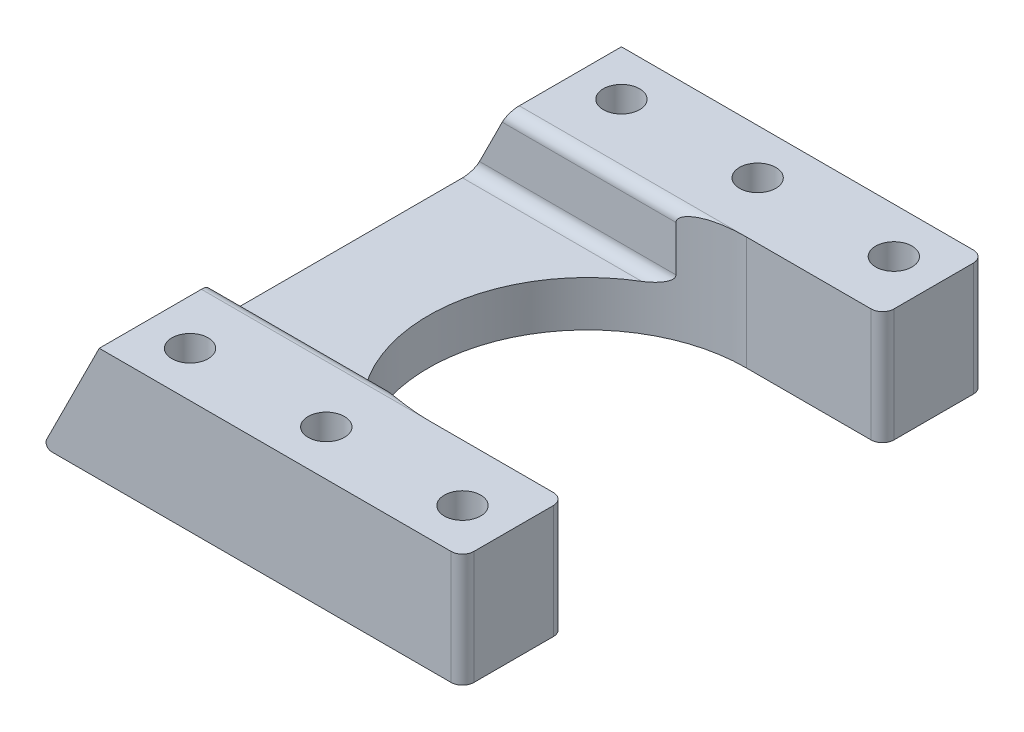
ISO-10303-21;
HEADER;
FILE_DESCRIPTION(('STEP AP214'),'2;1');
FILE_NAME('part.step','',(''),(''),'','','');
FILE_SCHEMA(('AUTOMOTIVE_DESIGN { 1 0 10303 214 1 1 1 1 }'));
ENDSEC;
DATA;
#1=APPLICATION_CONTEXT('core data for automotive mechanical design processes');
#2=APPLICATION_PROTOCOL_DEFINITION('international standard','automotive_design',2000,#1);
#3=PRODUCT_CONTEXT('',#1,'mechanical');
#4=PRODUCT('Part','Part','',(#3));
#5=PRODUCT_RELATED_PRODUCT_CATEGORY('part','',(#4));
#6=PRODUCT_DEFINITION_FORMATION('','',#4);
#7=PRODUCT_DEFINITION_CONTEXT('part definition',#1,'design');
#8=PRODUCT_DEFINITION('design','',#6,#7);
#9=PRODUCT_DEFINITION_SHAPE('','',#8);
#10=(LENGTH_UNIT() NAMED_UNIT(*) SI_UNIT(.MILLI.,.METRE.));
#11=(NAMED_UNIT(*) PLANE_ANGLE_UNIT() SI_UNIT($,.RADIAN.));
#12=(NAMED_UNIT(*) SI_UNIT($,.STERADIAN.) SOLID_ANGLE_UNIT());
#13=UNCERTAINTY_MEASURE_WITH_UNIT(LENGTH_MEASURE(1.E-05),#10,'distance_accuracy_value','');
#14=(GEOMETRIC_REPRESENTATION_CONTEXT(3) GLOBAL_UNCERTAINTY_ASSIGNED_CONTEXT((#13)) GLOBAL_UNIT_ASSIGNED_CONTEXT((#10,
#11,#12)) REPRESENTATION_CONTEXT('',''));
#15=CARTESIAN_POINT('',(0.,0.,0.));
#16=DIRECTION('',(0.,0.,1.));
#17=DIRECTION('',(1.,0.,0.));
#18=AXIS2_PLACEMENT_3D('',#15,#16,#17);
#19=CARTESIAN_POINT('',(0.,10.,0.));
#20=DIRECTION('',(0.,1.,0.));
#21=DIRECTION('',(0.,0.,1.));
#22=AXIS2_PLACEMENT_3D('',#19,#20,#21);
#23=PLANE('',#22);
#24=CARTESIAN_POINT('',(-12.,10.,19.));
#25=DIRECTION('',(0.,1.,0.));
#26=DIRECTION('',(0.,0.,1.));
#27=AXIS2_PLACEMENT_3D('',#24,#25,#26);
#28=CIRCLE('',#27,1.6);
#29=CARTESIAN_POINT('',(-12.,10.,20.6));
#30=VERTEX_POINT('',#29);
#31=EDGE_CURVE('E407',#30,#30,#28,.F.);
#32=ORIENTED_EDGE('',*,*,#31,.T.);
#33=EDGE_LOOP('',(#32));
#34=FACE_BOUND('',#33,.T.);
#35=CARTESIAN_POINT('',(12.,10.,19.));
#36=DIRECTION('',(0.,1.,0.));
#37=DIRECTION('',(0.,0.,1.));
#38=AXIS2_PLACEMENT_3D('',#35,#36,#37);
#39=CIRCLE('',#38,1.6);
#40=CARTESIAN_POINT('',(12.,10.,20.6));
#41=VERTEX_POINT('',#40);
#42=EDGE_CURVE('E466',#41,#41,#39,.T.);
#43=ORIENTED_EDGE('',*,*,#42,.F.);
#44=EDGE_LOOP('',(#43));
#45=FACE_BOUND('',#44,.T.);
#46=CARTESIAN_POINT('',(0.,10.,19.));
#47=DIRECTION('',(0.,1.,0.));
#48=DIRECTION('',(0.,0.,1.));
#49=AXIS2_PLACEMENT_3D('',#46,#47,#48);
#50=CIRCLE('',#49,1.6);
#51=CARTESIAN_POINT('',(0.,10.,20.6));
#52=VERTEX_POINT('',#51);
#53=EDGE_CURVE('E370',#52,#52,#50,.F.);
#54=ORIENTED_EDGE('',*,*,#53,.T.);
#55=EDGE_LOOP('',(#54));
#56=FACE_BOUND('',#55,.T.);
#57=DIRECTION('',(0.,0.,-1.));
#58=VECTOR('',#57,1.);
#59=CARTESIAN_POINT('',(16.,10.,0.));
#60=LINE('',#59,#58);
#61=CARTESIAN_POINT('',(16.,10.,22.));
#62=VERTEX_POINT('',#61);
#63=CARTESIAN_POINT('',(16.,10.,15.));
#64=VERTEX_POINT('',#63);
#65=EDGE_CURVE('E365',#62,#64,#60,.T.);
#66=ORIENTED_EDGE('',*,*,#65,.T.);
#67=CARTESIAN_POINT('',(15.,10.,15.));
#68=DIRECTION('',(0.,1.,0.));
#69=DIRECTION('',(0.,0.,1.));
#70=AXIS2_PLACEMENT_3D('',#67,#68,#69);
#71=CIRCLE('',#70,1.);
#72=CARTESIAN_POINT('',(15.,10.,14.));
#73=VERTEX_POINT('',#72);
#74=EDGE_CURVE('E43',#64,#73,#71,.T.);
#75=ORIENTED_EDGE('',*,*,#74,.T.);
#76=DIRECTION('',(1.,0.,0.));
#77=VECTOR('',#76,1.);
#78=CARTESIAN_POINT('',(0.,10.,14.));
#79=LINE('',#78,#77);
#80=CARTESIAN_POINT('',(4.,10.,14.));
#81=VERTEX_POINT('',#80);
#82=EDGE_CURVE('E363',#81,#73,#79,.T.);
#83=ORIENTED_EDGE('',*,*,#82,.F.);
#84=DIRECTION('',(-1.,0.,0.));
#85=VECTOR('',#84,1.);
#86=CARTESIAN_POINT('',(0.,10.,14.));
#87=LINE('',#86,#85);
#88=CARTESIAN_POINT('',(-16.,10.,14.));
#89=VERTEX_POINT('',#88);
#90=EDGE_CURVE('E430',#81,#89,#87,.T.);
#91=ORIENTED_EDGE('',*,*,#90,.T.);
#92=DIRECTION('',(0.,0.,-1.));
#93=VECTOR('',#92,1.);
#94=CARTESIAN_POINT('',(-16.,10.,0.));
#95=LINE('',#94,#93);
#96=CARTESIAN_POINT('',(-16.,10.,23.));
#97=VERTEX_POINT('',#96);
#98=EDGE_CURVE('E460',#97,#89,#95,.T.);
#99=ORIENTED_EDGE('',*,*,#98,.F.);
#100=DIRECTION('',(-1.,0.,0.));
#101=VECTOR('',#100,1.);
#102=CARTESIAN_POINT('',(0.,10.,23.));
#103=LINE('',#102,#101);
#104=CARTESIAN_POINT('',(15.,10.,23.));
#105=VERTEX_POINT('',#104);
#106=EDGE_CURVE('E457',#105,#97,#103,.T.);
#107=ORIENTED_EDGE('',*,*,#106,.F.);
#108=CARTESIAN_POINT('',(15.,10.,22.));
#109=DIRECTION('',(0.,1.,0.));
#110=DIRECTION('',(0.,0.,1.));
#111=AXIS2_PLACEMENT_3D('',#108,#109,#110);
#112=CIRCLE('',#111,1.);
#113=EDGE_CURVE('E358',#105,#62,#112,.T.);
#114=ORIENTED_EDGE('',*,*,#113,.T.);
#115=EDGE_LOOP('',(#66,#75,#83,#91,#99,#107,#114));
#116=FACE_BOUND('',#115,.T.);
#117=ADVANCED_FACE('F35',(#34,#45,#56,#116),#23,.T.);
#118=CARTESIAN_POINT('',(4.,10.,0.));
#119=DIRECTION('',(0.,-1.,0.));
#120=DIRECTION('',(0.,0.,-1.));
#121=AXIS2_PLACEMENT_3D('',#118,#119,#120);
#122=CYLINDRICAL_SURFACE('',#121,14.);
#123=DIRECTION('',(0.,1.,0.));
#124=VECTOR('',#123,1.);
#125=CARTESIAN_POINT('',(-1.19615242270666,4.,13.));
#126=LINE('',#125,#124);
#127=CARTESIAN_POINT('',(-1.19615242270666,5.,13.));
#128=VERTEX_POINT('',#127);
#129=CARTESIAN_POINT('',(-1.19615242270666,9.,13.));
#130=VERTEX_POINT('',#129);
#131=EDGE_CURVE('E441',#128,#130,#126,.T.);
#132=ORIENTED_EDGE('',*,*,#131,.T.);
#133=CARTESIAN_POINT('',(-1.19615242270666,9.,13.));
#134=CARTESIAN_POINT('',(-1.19621155929245,9.02326883844908,12.9999746090349));
#135=CARTESIAN_POINT('',(-1.19412366838426,9.04645231571868,13.0008109831838));
#136=CARTESIAN_POINT('',(-1.18620671547382,9.09178549195957,13.003972054622));
#137=CARTESIAN_POINT('',(-1.18042377587522,9.11394437325585,13.0062784025037));
#138=CARTESIAN_POINT('',(-1.16393306040799,9.16194990718617,13.0128353920137));
#139=CARTESIAN_POINT('',(-1.15239436440986,9.18746056263273,13.0174128243628));
#140=CARTESIAN_POINT('',(-1.12561377801982,9.23623202340418,13.0279811762719));
#141=CARTESIAN_POINT('',(-1.11035332028763,9.25948070414224,13.0339791783796));
#142=CARTESIAN_POINT('',(-1.06702980540213,9.31716391395134,13.0509011677575));
#143=CARTESIAN_POINT('',(-1.03684096871949,9.34975507401489,13.0625959329902));
#144=CARTESIAN_POINT('',(-0.972346066889078,9.40988465234473,13.0872831285143));
#145=CARTESIAN_POINT('',(-0.938032150146151,9.43741317438558,13.1002780253085));
#146=CARTESIAN_POINT('',(-0.865845951071429,9.48908245903096,13.1272642768222));
#147=CARTESIAN_POINT('',(-0.82790371472551,9.51311479623987,13.1412728684084));
#148=CARTESIAN_POINT('',(-0.750142360013684,9.55776590692111,13.1695810401844));
#149=CARTESIAN_POINT('',(-0.710321265336998,9.57838097819591,13.183880917363));
#150=CARTESIAN_POINT('',(-0.629279929652227,9.61685266907429,13.2125553862747));
#151=CARTESIAN_POINT('',(-0.588056556821592,9.63470254198432,13.2269300749717));
#152=CARTESIAN_POINT('',(-0.504666444073828,9.66805215967762,13.2555620363969));
#153=CARTESIAN_POINT('',(-0.462500161574032,9.6835530167846,13.2698193616562));
#154=CARTESIAN_POINT('',(-0.350950248488156,9.7216281193214,13.3069348724708));
#155=CARTESIAN_POINT('',(-0.280963396964905,9.74259892788923,13.3296223342599));
#156=CARTESIAN_POINT('',(-0.139640736942752,9.78051939433019,13.3741868702506));
#157=CARTESIAN_POINT('',(-0.0683042269395927,9.7974668953796,13.3960635045031));
#158=CARTESIAN_POINT('',(0.0754663780222312,9.8281586982092,13.4388865259337));
#159=CARTESIAN_POINT('',(0.147902195321745,9.84189726523543,13.4598311943324));
#160=CARTESIAN_POINT('',(0.293526692814418,9.86673325489727,13.5006584664385));
#161=CARTESIAN_POINT('',(0.366715498056652,9.87783023120812,13.520540890229));
#162=CARTESIAN_POINT('',(0.588204252734463,9.9080206344283,13.5787720721421));
#163=CARTESIAN_POINT('',(0.737409120716898,9.92381153792844,13.6154010713851));
#164=CARTESIAN_POINT('',(1.03724221840706,9.94937995136098,13.6837753636723));
#165=CARTESIAN_POINT('',(1.18786891174778,9.95916333289377,13.7155254024547));
#166=CARTESIAN_POINT('',(1.4497847835244,9.97254351623535,13.7662311376353));
#167=CARTESIAN_POINT('',(1.56080623327312,9.97709544733007,13.7863361622911));
#168=CARTESIAN_POINT('',(1.78335718287695,9.98455093978449,13.8238645922267));
#169=CARTESIAN_POINT('',(1.89488670653176,9.98745442310876,13.8412878705276));
#170=CARTESIAN_POINT('',(2.23022155239792,9.99441802019285,13.8895247564849));
#171=CARTESIAN_POINT('',(2.45466399118253,9.99672670065982,13.9162842777269));
#172=CARTESIAN_POINT('',(2.78935215926388,9.99869698868909,13.9479924957282));
#173=CARTESIAN_POINT('',(2.89922541894034,9.99910870294574,13.9570932475038));
#174=CARTESIAN_POINT('',(3.11916113347007,9.99965858045486,13.9726974453088));
#175=CARTESIAN_POINT('',(3.22922358876056,9.99979674307431,13.9792008853279));
#176=CARTESIAN_POINT('',(3.4493746733248,9.99995991630208,13.9896013317003));
#177=CARTESIAN_POINT('',(3.55946319663439,9.99998502518918,13.9935005993751));
#178=CARTESIAN_POINT('',(3.77970097700538,9.99999976722169,13.9987000288461));
#179=CARTESIAN_POINT('',(3.88985023371476,9.99998940057059,14.000000205551));
#180=CARTESIAN_POINT('',(4.,10.,14.));
#181=B_SPLINE_CURVE_WITH_KNOTS('',3,(#133,#134,#135,#136,#137,#138,#139,#140,#141,#142,#143,
#144,#145,#146,#147,#148,#149,#150,#151,#152,#153,#154,#155,#156,#157,#158,#159,#160,#161,#162,
#163,#164,#165,#166,#167,#168,#169,#170,#171,#172,#173,#174,#175,#176,#177,#178,#179,#180),
.UNSPECIFIED.,.F.,.F.,(4,2,2,2,2,2,2,2,2,2,2,2,2,2,2,2,2,2,2,2,2,2,2,4),(0.,0.0695604029523801,
0.138269062520741,0.222906459420441,0.307975062569036,0.445014168846956,0.582318370153341,
0.723241793143243,0.864316905811288,1.0057309772623,1.14707787459053,1.37641254587527,
1.6058698831761,1.83573420349717,2.06563733430892,2.52867899895899,2.99126737501997,
3.32997632171573,3.6687013011269,4.34648468623733,4.67721398820826,5.00794405551398,
5.3383865601396,5.66882716931128),.UNSPECIFIED.);
#182=EDGE_CURVE('E187',#130,#81,#181,.T.);
#183=ORIENTED_EDGE('',*,*,#182,.T.);
#184=DIRECTION('',(0.,-1.,0.));
#185=VECTOR('',#184,1.);
#186=CARTESIAN_POINT('',(4.,10.,14.));
#187=LINE('',#186,#185);
#188=CARTESIAN_POINT('',(4.,0.,14.));
#189=VERTEX_POINT('',#188);
#190=EDGE_CURVE('E203',#81,#189,#187,.T.);
#191=ORIENTED_EDGE('',*,*,#190,.T.);
#192=CARTESIAN_POINT('',(4.,0.,0.));
#193=DIRECTION('',(0.,1.,0.));
#194=DIRECTION('',(0.,0.,1.));
#195=AXIS2_PLACEMENT_3D('',#192,#193,#194);
#196=CIRCLE('',#195,14.);
#197=CARTESIAN_POINT('',(4.,0.,-14.));
#198=VERTEX_POINT('',#197);
#199=EDGE_CURVE('E198',#198,#189,#196,.T.);
#200=ORIENTED_EDGE('',*,*,#199,.F.);
#201=DIRECTION('',(0.,-1.,0.));
#202=VECTOR('',#201,1.);
#203=CARTESIAN_POINT('',(4.,10.,-14.));
#204=LINE('',#203,#202);
#205=CARTESIAN_POINT('',(4.,10.,-14.));
#206=VERTEX_POINT('',#205);
#207=EDGE_CURVE('E191',#206,#198,#204,.T.);
#208=ORIENTED_EDGE('',*,*,#207,.F.);
#209=CARTESIAN_POINT('',(4.,10.,-14.));
#210=CARTESIAN_POINT('',(3.91667270580262,9.999997382173,-13.9999999921816));
#211=CARTESIAN_POINT('',(3.83334724636329,10.0000003507679,-13.999256038613));
#212=CARTESIAN_POINT('',(3.66672282750631,9.99999466876353,-13.9962805711568));
#213=CARTESIAN_POINT('',(3.58342386810937,9.99998601815529,-13.9940490561092));
#214=CARTESIAN_POINT('',(3.33358515966063,9.9999084444079,-13.9851230948774));
#215=CARTESIAN_POINT('',(3.16711962047872,9.99978789107919,-13.9761972327059));
#216=CARTESIAN_POINT('',(2.83346497470961,9.99893442277258,-13.9523247368353));
#217=CARTESIAN_POINT('',(2.6662788599673,9.99819726541892,-13.9373367644087));
#218=CARTESIAN_POINT('',(2.33257613759479,9.99528757128193,-13.9013616368291));
#219=CARTESIAN_POINT('',(2.16605946980408,9.99311516651687,-13.8803750335486));
#220=CARTESIAN_POINT('',(1.85262444854146,9.98654970055919,-13.8351346735981));
#221=CARTESIAN_POINT('',(1.70560900104655,9.98243399406508,-13.8115141905749));
#222=CARTESIAN_POINT('',(1.41248664657182,9.9710417338234,-13.7596121899918));
#223=CARTESIAN_POINT('',(1.2663799146633,9.96376458903232,-13.7313298014839));
#224=CARTESIAN_POINT('',(0.97595069753571,9.944625186677,-13.6702986811321));
#225=CARTESIAN_POINT('',(0.831623654383101,9.93277970975279,-13.6375665758775));
#226=CARTESIAN_POINT('',(0.54475083610507,9.90254849248921,-13.5677194020871));
#227=CARTESIAN_POINT('',(0.402204161606079,9.8841662050913,-13.5306066544408));
#228=CARTESIAN_POINT('',(0.173208643576799,9.8466727193343,-13.4671444173303));
#229=CARTESIAN_POINT('',(0.0859416085731874,9.8304690018882,-13.4420356423507));
#230=CARTESIAN_POINT('',(-0.0873901028472296,9.79331439416493,-13.3903481870802));
#231=CARTESIAN_POINT('',(-0.173451726825549,9.77235318313454,-13.3637664074929));
#232=CARTESIAN_POINT('',(-0.306983321158923,9.73454753243577,-13.321129668914));
#233=CARTESIAN_POINT('',(-0.355166563052418,9.71979616796571,-13.3054521233923));
#234=CARTESIAN_POINT('',(-0.45062988049977,9.68787753605931,-13.2738245597088));
#235=CARTESIAN_POINT('',(-0.497910201018883,9.67071093477097,-13.2578746177391));
#236=CARTESIAN_POINT('',(-0.591122516401272,9.63351790348163,-13.2258842598309));
#237=CARTESIAN_POINT('',(-0.637058292092062,9.61350066002125,-13.2098442876471));
#238=CARTESIAN_POINT('',(-0.727220554930757,9.56991070759181,-13.1778475722153));
#239=CARTESIAN_POINT('',(-0.771448627360082,9.54634140083754,-13.1618907642811));
#240=CARTESIAN_POINT('',(-0.846239840091492,9.50140892203561,-13.1345007687811));
#241=CARTESIAN_POINT('',(-0.877371152330155,9.48105993366344,-13.1229680545084));
#242=CARTESIAN_POINT('',(-0.93774930020033,9.43734578866155,-13.1003690805453));
#243=CARTESIAN_POINT('',(-0.966992870902146,9.41397560578894,-13.089303639879));
#244=CARTESIAN_POINT('',(-1.0229274047952,9.36336348166741,-13.0679418756553));
#245=CARTESIAN_POINT('',(-1.04958689955929,9.33608193523571,-13.057655304188));
#246=CARTESIAN_POINT('',(-1.09834972576941,9.2771956107542,-13.0386927598236));
#247=CARTESIAN_POINT('',(-1.12046817119275,9.24560577618087,-13.0300114540308));
#248=CARTESIAN_POINT('',(-1.15019529318978,9.19146370202843,-13.0182808297621));
#249=CARTESIAN_POINT('',(-1.16006901319736,9.17035035364829,-13.0143676893522));
#250=CARTESIAN_POINT('',(-1.17655590347143,9.12672439134974,-13.0078187163056));
#251=CARTESIAN_POINT('',(-1.18317867478326,9.10421612154,-13.005179122895));
#252=CARTESIAN_POINT('',(-1.19059234114798,9.06794641743643,-13.0022213457352));
#253=CARTESIAN_POINT('',(-1.1926643243312,9.05448015086148,-13.001393810887));
#254=CARTESIAN_POINT('',(-1.19544992672893,9.02734668889408,-13.0002807955507));
#255=CARTESIAN_POINT('',(-1.19615954874276,9.0136790204396,-12.9999969101493));
#256=CARTESIAN_POINT('',(-1.19615242270667,9.,-13.));
#257=B_SPLINE_CURVE_WITH_KNOTS('',3,(#209,#210,#211,#212,#213,#214,#215,#216,#217,#218,#219,
#220,#221,#222,#223,#224,#225,#226,#227,#228,#229,#230,#231,#232,#233,#234,#235,#236,#237,#238,
#239,#240,#241,#242,#243,#244,#245,#246,#247,#248,#249,#250,#251,#252,#253,#254,#255,#256),
.UNSPECIFIED.,.F.,.F.,(4,2,2,2,2,2,2,2,2,2,2,2,2,2,2,2,2,2,2,2,2,2,2,4),(0.,0.24997489271353,
0.499949980361239,0.999948248263364,1.50341518777454,2.00683582336483,2.45361488313939,
2.9004775060122,3.34571408748745,3.79071583001053,4.06734215043893,4.34457441025026,
4.5028450909286,4.66107220413448,4.81880048906629,4.97637864871527,5.09307293663993,
5.20996392470071,5.328135271671,5.44590669410742,5.51657277116685,5.58702887490565,
5.62790465416739,5.66890018176074),.UNSPECIFIED.);
#258=CARTESIAN_POINT('',(-1.19615242270666,9.,-13.));
#259=VERTEX_POINT('',#258);
#260=EDGE_CURVE('E195',#206,#259,#257,.T.);
#261=ORIENTED_EDGE('',*,*,#260,.T.);
#262=DIRECTION('',(0.,1.,0.));
#263=VECTOR('',#262,1.);
#264=CARTESIAN_POINT('',(-1.19615242270666,4.,-13.));
#265=LINE('',#264,#263);
#266=CARTESIAN_POINT('',(-1.19615242270666,5.,-13.));
#267=VERTEX_POINT('',#266);
#268=EDGE_CURVE('E438',#267,#259,#265,.T.);
#269=ORIENTED_EDGE('',*,*,#268,.F.);
#270=CARTESIAN_POINT('',(-1.19615242270666,5.,-13.));
#271=CARTESIAN_POINT('',(-1.1960825527967,4.97616947585144,-13.0000260880498));
#272=CARTESIAN_POINT('',(-1.19828045897355,4.9524447917133,-12.9991495266409));
#273=CARTESIAN_POINT('',(-1.2065439150981,4.90611315282051,-12.9958428658323));
#274=CARTESIAN_POINT('',(-1.21255585022912,4.88349531246433,-12.9934343010053));
#275=CARTESIAN_POINT('',(-1.22988603155872,4.83362661474541,-12.9864696511788));
#276=CARTESIAN_POINT('',(-1.24220273480728,4.80678866173612,-12.9815076657905));
#277=CARTESIAN_POINT('',(-1.27062142015569,4.75545052033216,-12.9699957266748));
#278=CARTESIAN_POINT('',(-1.28674553022625,4.73096522215295,-12.9634364827213));
#279=CARTESIAN_POINT('',(-1.33447484551546,4.66702232814981,-12.9438956407086));
#280=CARTESIAN_POINT('',(-1.36870098585942,4.62990735931081,-12.9297555032203));
#281=CARTESIAN_POINT('',(-1.44134659077134,4.56116726129249,-12.8993534920001));
#282=CARTESIAN_POINT('',(-1.47977546157365,4.52955487465583,-12.8830868423036));
#283=CARTESIAN_POINT('',(-1.563280447697,4.46749972316987,-12.8472636455486));
#284=CARTESIAN_POINT('',(-1.60863097688795,4.43752757200054,-12.8275409875363));
#285=CARTESIAN_POINT('',(-1.70119141813956,4.38166094090691,-12.7866722038244));
#286=CARTESIAN_POINT('',(-1.74840334391552,4.35577103750437,-12.7655245179224));
#287=CARTESIAN_POINT('',(-1.84420687025744,4.30728552661136,-12.721950611533));
#288=CARTESIAN_POINT('',(-1.89280362737005,4.28470491525307,-12.6995191749121));
#289=CARTESIAN_POINT('',(-1.99075320197156,4.24252700741248,-12.6536083852518));
#290=CARTESIAN_POINT('',(-2.04010577036381,4.22292875035736,-12.6301293727855));
#291=CARTESIAN_POINT('',(-2.18312415907859,4.17026275448213,-12.5610396768027));
#292=CARTESIAN_POINT('',(-2.27744916912481,4.14057695405149,-12.5141884336242));
#293=CARTESIAN_POINT('',(-2.46683331294052,4.08962806294141,-12.4173831987058));
#294=CARTESIAN_POINT('',(-2.56189299149759,4.06837199009579,-12.3674266616274));
#295=CARTESIAN_POINT('',(-2.74979402056507,4.03453948172846,-12.2658637297546));
#296=CARTESIAN_POINT('',(-2.84263582642963,4.0217736654036,-12.2143222190176));
#297=CARTESIAN_POINT('',(-2.98134714975036,4.00882596808806,-12.1352224952575));
#298=CARTESIAN_POINT('',(-3.02746384189736,4.00554369137089,-12.1085751429506));
#299=CARTESIAN_POINT('',(-3.11947090556644,4.00113277333784,-12.0547076897138));
#300=CARTESIAN_POINT('',(-3.16536125290369,4.00000435739318,-12.0274875291488));
#301=CARTESIAN_POINT('',(-3.211102550928,4.,-12.));
#302=B_SPLINE_CURVE_WITH_KNOTS('',3,(#270,#271,#272,#273,#274,#275,#276,#277,#278,#279,#280,
#281,#282,#283,#284,#285,#286,#287,#288,#289,#290,#291,#292,#293,#294,#295,#296,#297,#298,#299,
#300,#301),.UNSPECIFIED.,.F.,.F.,(4,2,2,2,2,2,2,2,2,2,2,2,2,2,2,4),(0.,0.0712042871115645,
0.141429167724377,0.230752713480961,0.320608755665712,0.477017286197905,0.633783333852331,
0.806995291937516,0.980400074431057,1.15456783804878,1.32867938549434,1.65648979139621,
1.98457253276401,2.30506703044832,2.46511527121145,2.62518025785366),.UNSPECIFIED.);
#303=CARTESIAN_POINT('',(-3.211102550928,4.,-12.));
#304=VERTEX_POINT('',#303);
#305=EDGE_CURVE('E489',#267,#304,#302,.T.);
#306=ORIENTED_EDGE('',*,*,#305,.T.);
#307=CARTESIAN_POINT('',(4.,4.,0.));
#308=DIRECTION('',(0.,1.,0.));
#309=DIRECTION('',(0.,0.,1.));
#310=AXIS2_PLACEMENT_3D('',#307,#308,#309);
#311=CIRCLE('',#310,14.);
#312=CARTESIAN_POINT('',(-3.211102550928,4.,12.));
#313=VERTEX_POINT('',#312);
#314=EDGE_CURVE('E446',#313,#304,#311,.F.);
#315=ORIENTED_EDGE('',*,*,#314,.F.);
#316=CARTESIAN_POINT('',(-3.211102550928,4.,12.));
#317=CARTESIAN_POINT('',(-3.16334340588644,4.00000512759333,12.0287001762389));
#318=CARTESIAN_POINT('',(-3.11542233457701,4.00123484242815,12.0571084580712));
#319=CARTESIAN_POINT('',(-3.01933713495311,4.00603801800372,12.1132985459271));
#320=CARTESIAN_POINT('',(-2.97117303344521,4.00961122562895,12.1410804192726));
#321=CARTESIAN_POINT('',(-2.8262734100482,4.02370282685325,12.2235160487523));
#322=CARTESIAN_POINT('',(-2.72927791180995,4.03759254607148,12.2771713031331));
#323=CARTESIAN_POINT('',(-2.53579291814276,4.07389552161383,12.3812531410261));
#324=CARTESIAN_POINT('',(-2.43930323423435,4.09626743210853,12.4316940213));
#325=CARTESIAN_POINT('',(-2.24719246424403,4.14975745301159,12.529332138451));
#326=CARTESIAN_POINT('',(-2.15157057323012,4.1808663646954,12.5765327221705));
#327=CARTESIAN_POINT('',(-2.00005095847824,4.23862400287934,12.6492443641411));
#328=CARTESIAN_POINT('',(-1.94349897242229,4.26211505035079,12.6759071351306));
#329=CARTESIAN_POINT('',(-1.83144152765479,4.31328975659215,12.7278480254067));
#330=CARTESIAN_POINT('',(-1.77593936014369,4.34098472419649,12.753122151538));
#331=CARTESIAN_POINT('',(-1.65933909286668,4.40551624735346,12.8053298085071));
#332=CARTESIAN_POINT('',(-1.5985182982925,4.44308575162671,12.8320150875402));
#333=CARTESIAN_POINT('',(-1.51103022389037,4.5058525569107,12.8697149081199));
#334=CARTESIAN_POINT('',(-1.48253290658512,4.52780439890595,12.8818763451223));
#335=CARTESIAN_POINT('',(-1.42732212730874,4.57428892917164,12.9052340622159));
#336=CARTESIAN_POINT('',(-1.40060649505072,4.5988183801726,12.9164315215613));
#337=CARTESIAN_POINT('',(-1.35475518079879,4.6459399406915,12.9354972807877));
#338=CARTESIAN_POINT('',(-1.33515476029708,4.66798388200906,12.9435898998099));
#339=CARTESIAN_POINT('',(-1.29841588165105,4.71444071140623,12.9586720749603));
#340=CARTESIAN_POINT('',(-1.28127767186485,4.73885383804513,12.9656615198205));
#341=CARTESIAN_POINT('',(-1.25282309657136,4.78653663917224,12.9772127678664));
#342=CARTESIAN_POINT('',(-1.24102348411473,4.80946287043972,12.9819793491414));
#343=CARTESIAN_POINT('',(-1.22105887477522,4.85705199381009,12.9900215885512));
#344=CARTESIAN_POINT('',(-1.21287983535644,4.88170773880558,12.9933030080766));
#345=CARTESIAN_POINT('',(-1.2034532340149,4.92213329997657,12.9970800402));
#346=CARTESIAN_POINT('',(-1.20074170391645,4.93751191194176,12.9981649581641));
#347=CARTESIAN_POINT('',(-1.19707950668588,4.96858635412507,12.9996294501419));
#348=CARTESIAN_POINT('',(-1.19613769458118,4.98428338440691,13.0000054771529));
#349=CARTESIAN_POINT('',(-1.19615242270667,5.,13.));
#350=B_SPLINE_CURVE_WITH_KNOTS('',3,(#316,#317,#318,#319,#320,#321,#322,#323,#324,#325,#326,
#327,#328,#329,#330,#331,#332,#333,#334,#335,#336,#337,#338,#339,#340,#341,#342,#343,#344,#345,
#346,#347,#348,#349),.UNSPECIFIED.,.F.,.F.,(4,2,2,2,2,2,2,2,2,2,2,2,2,2,2,2,4),(0.,
0.167123048761749,0.334228049900897,0.668952021756267,1.00206495590587,1.33482847948588,
1.53506927186582,1.73585859791949,1.96420253717265,2.07802022639307,2.19169664058168,
2.28330750698462,2.37492760750882,2.4533253554469,2.53141631184481,2.57826615607083,
2.62534980208321),.UNSPECIFIED.);
#351=EDGE_CURVE('E507',#313,#128,#350,.T.);
#352=ORIENTED_EDGE('',*,*,#351,.T.);
#353=EDGE_LOOP('',(#132,#183,#191,#200,#208,#261,#269,#306,#315,#352));
#354=FACE_BOUND('',#353,.T.);
#355=ADVANCED_FACE('F193',(#354),#122,.F.);
#356=CARTESIAN_POINT('',(0.,10.,-14.));
#357=DIRECTION('',(0.,0.,-1.));
#358=DIRECTION('',(-1.,0.,0.));
#359=AXIS2_PLACEMENT_3D('',#356,#357,#358);
#360=PLANE('',#359);
#361=DIRECTION('',(1.,0.,0.));
#362=VECTOR('',#361,1.);
#363=CARTESIAN_POINT('',(0.,0.,-14.));
#364=LINE('',#363,#362);
#365=CARTESIAN_POINT('',(15.,0.,-14.));
#366=VERTEX_POINT('',#365);
#367=EDGE_CURVE('E335',#198,#366,#364,.T.);
#368=ORIENTED_EDGE('',*,*,#367,.T.);
#369=DIRECTION('',(0.,-1.,0.));
#370=VECTOR('',#369,1.);
#371=CARTESIAN_POINT('',(15.,10.,-14.));
#372=LINE('',#371,#370);
#373=CARTESIAN_POINT('',(15.,10.,-14.));
#374=VERTEX_POINT('',#373);
#375=EDGE_CURVE('E207',#366,#374,#372,.F.);
#376=ORIENTED_EDGE('',*,*,#375,.T.);
#377=DIRECTION('',(1.,0.,0.));
#378=VECTOR('',#377,1.);
#379=CARTESIAN_POINT('',(0.,10.,-14.));
#380=LINE('',#379,#378);
#381=EDGE_CURVE('E180',#206,#374,#380,.T.);
#382=ORIENTED_EDGE('',*,*,#381,.F.);
#383=ORIENTED_EDGE('',*,*,#207,.T.);
#384=EDGE_LOOP('',(#368,#376,#382,#383));
#385=FACE_BOUND('',#384,.T.);
#386=ADVANCED_FACE('F205',(#385),#360,.F.);
#387=CARTESIAN_POINT('',(16.,10.,0.));
#388=DIRECTION('',(-1.,0.,0.));
#389=DIRECTION('',(0.,0.,1.));
#390=AXIS2_PLACEMENT_3D('',#387,#388,#389);
#391=PLANE('',#390);
#392=DIRECTION('',(0.,0.,-1.));
#393=VECTOR('',#392,1.);
#394=CARTESIAN_POINT('',(16.,0.,0.));
#395=LINE('',#394,#393);
#396=CARTESIAN_POINT('',(16.,0.,-15.));
#397=VERTEX_POINT('',#396);
#398=CARTESIAN_POINT('',(16.,0.,-22.));
#399=VERTEX_POINT('',#398);
#400=EDGE_CURVE('E327',#397,#399,#395,.T.);
#401=ORIENTED_EDGE('',*,*,#400,.T.);
#402=DIRECTION('',(0.,-1.,0.));
#403=VECTOR('',#402,1.);
#404=CARTESIAN_POINT('',(16.,10.,-22.));
#405=LINE('',#404,#403);
#406=CARTESIAN_POINT('',(16.,10.,-22.));
#407=VERTEX_POINT('',#406);
#408=EDGE_CURVE('E330',#399,#407,#405,.F.);
#409=ORIENTED_EDGE('',*,*,#408,.T.);
#410=CARTESIAN_POINT('',(16.,10.,-15.));
#411=VERTEX_POINT('',#410);
#412=EDGE_CURVE('E208',#411,#407,#60,.T.);
#413=ORIENTED_EDGE('',*,*,#412,.F.);
#414=DIRECTION('',(0.,-1.,0.));
#415=VECTOR('',#414,1.);
#416=CARTESIAN_POINT('',(16.,10.,-15.));
#417=LINE('',#416,#415);
#418=EDGE_CURVE('E332',#411,#397,#417,.T.);
#419=ORIENTED_EDGE('',*,*,#418,.T.);
#420=EDGE_LOOP('',(#401,#409,#413,#419));
#421=FACE_BOUND('',#420,.T.);
#422=ADVANCED_FACE('F311',(#421),#391,.F.);
#423=CARTESIAN_POINT('',(0.,10.,-23.));
#424=DIRECTION('',(0.,0.,1.));
#425=DIRECTION('',(1.,0.,0.));
#426=AXIS2_PLACEMENT_3D('',#423,#424,#425);
#427=PLANE('',#426);
#428=DIRECTION('',(-1.,0.,0.));
#429=VECTOR('',#428,1.);
#430=CARTESIAN_POINT('',(0.,10.,-23.));
#431=LINE('',#430,#429);
#432=CARTESIAN_POINT('',(15.,10.,-23.));
#433=VERTEX_POINT('',#432);
#434=CARTESIAN_POINT('',(-16.,10.,-23.));
#435=VERTEX_POINT('',#434);
#436=EDGE_CURVE('E458',#433,#435,#431,.T.);
#437=ORIENTED_EDGE('',*,*,#436,.F.);
#438=DIRECTION('',(0.,-1.,0.));
#439=VECTOR('',#438,1.);
#440=CARTESIAN_POINT('',(15.,10.,-23.));
#441=LINE('',#440,#439);
#442=CARTESIAN_POINT('',(15.,0.,-23.));
#443=VERTEX_POINT('',#442);
#444=EDGE_CURVE('E378',#433,#443,#441,.T.);
#445=ORIENTED_EDGE('',*,*,#444,.T.);
#446=DIRECTION('',(-1.,0.,0.));
#447=VECTOR('',#446,1.);
#448=CARTESIAN_POINT('',(0.,0.,-23.));
#449=LINE('',#448,#447);
#450=CARTESIAN_POINT('',(-20.1909830056251,0.,-23.));
#451=VERTEX_POINT('',#450);
#452=EDGE_CURVE('E334',#443,#451,#449,.T.);
#453=ORIENTED_EDGE('',*,*,#452,.T.);
#454=CARTESIAN_POINT('',(-20.1909830056251,0.5,-23.));
#455=DIRECTION('',(0.,0.,1.));
#456=DIRECTION('',(1.,0.,0.));
#457=AXIS2_PLACEMENT_3D('',#454,#455,#456);
#458=CIRCLE('',#457,0.5);
#459=CARTESIAN_POINT('',(-20.638196601125,0.723606797749975,-23.));
#460=VERTEX_POINT('',#459);
#461=EDGE_CURVE('E479',#451,#460,#458,.F.);
#462=ORIENTED_EDGE('',*,*,#461,.T.);
#463=DIRECTION('',(-0.447213595499958,-0.894427190999916,0.));
#464=VECTOR('',#463,1.);
#465=CARTESIAN_POINT('',(-16.8,8.4,-23.));
#466=LINE('',#465,#464);
#467=EDGE_CURVE('E444',#435,#460,#466,.T.);
#468=ORIENTED_EDGE('',*,*,#467,.F.);
#469=EDGE_LOOP('',(#437,#445,#453,#462,#468));
#470=FACE_BOUND('',#469,.T.);
#471=ADVANCED_FACE('F314',(#470),#427,.F.);
#472=CARTESIAN_POINT('',(0.,10.,23.));
#473=DIRECTION('',(0.,0.,1.));
#474=DIRECTION('',(1.,0.,0.));
#475=AXIS2_PLACEMENT_3D('',#472,#473,#474);
#476=PLANE('',#475);
#477=DIRECTION('',(-1.,0.,0.));
#478=VECTOR('',#477,1.);
#479=CARTESIAN_POINT('',(0.,0.,23.));
#480=LINE('',#479,#478);
#481=CARTESIAN_POINT('',(15.,0.,23.));
#482=VERTEX_POINT('',#481);
#483=CARTESIAN_POINT('',(-20.1909830056251,0.,23.));
#484=VERTEX_POINT('',#483);
#485=EDGE_CURVE('E387',#482,#484,#480,.T.);
#486=ORIENTED_EDGE('',*,*,#485,.F.);
#487=DIRECTION('',(0.,-1.,0.));
#488=VECTOR('',#487,1.);
#489=CARTESIAN_POINT('',(15.,10.,23.));
#490=LINE('',#489,#488);
#491=EDGE_CURVE('E11',#482,#105,#490,.F.);
#492=ORIENTED_EDGE('',*,*,#491,.T.);
#493=ORIENTED_EDGE('',*,*,#106,.T.);
#494=DIRECTION('',(0.447213595499958,0.894427190999916,0.));
#495=VECTOR('',#494,1.);
#496=CARTESIAN_POINT('',(-16.8,8.4,23.));
#497=LINE('',#496,#495);
#498=CARTESIAN_POINT('',(-20.638196601125,0.723606797749976,23.));
#499=VERTEX_POINT('',#498);
#500=EDGE_CURVE('E440',#499,#97,#497,.T.);
#501=ORIENTED_EDGE('',*,*,#500,.F.);
#502=CARTESIAN_POINT('',(-20.1909830056251,0.5,23.));
#503=DIRECTION('',(0.,0.,1.));
#504=DIRECTION('',(1.,0.,0.));
#505=AXIS2_PLACEMENT_3D('',#502,#503,#504);
#506=CIRCLE('',#505,0.5);
#507=EDGE_CURVE('E483',#499,#484,#506,.T.);
#508=ORIENTED_EDGE('',*,*,#507,.T.);
#509=EDGE_LOOP('',(#486,#492,#493,#501,#508));
#510=FACE_BOUND('',#509,.T.);
#511=ADVANCED_FACE('F310',(#510),#476,.T.);
#512=CARTESIAN_POINT('',(16.,0.,22.));
#513=VERTEX_POINT('',#512);
#514=CARTESIAN_POINT('',(16.,0.,15.));
#515=VERTEX_POINT('',#514);
#516=EDGE_CURVE('E337',#513,#515,#395,.T.);
#517=ORIENTED_EDGE('',*,*,#516,.T.);
#518=DIRECTION('',(0.,-1.,0.));
#519=VECTOR('',#518,1.);
#520=CARTESIAN_POINT('',(16.,10.,15.));
#521=LINE('',#520,#519);
#522=EDGE_CURVE('E56',#515,#64,#521,.F.);
#523=ORIENTED_EDGE('',*,*,#522,.T.);
#524=ORIENTED_EDGE('',*,*,#65,.F.);
#525=DIRECTION('',(0.,-1.,0.));
#526=VECTOR('',#525,1.);
#527=CARTESIAN_POINT('',(16.,0.,22.));
#528=LINE('',#527,#526);
#529=EDGE_CURVE('E354',#62,#513,#528,.T.);
#530=ORIENTED_EDGE('',*,*,#529,.T.);
#531=EDGE_LOOP('',(#517,#523,#524,#530));
#532=FACE_BOUND('',#531,.T.);
#533=ADVANCED_FACE('F295',(#532),#391,.F.);
#534=CARTESIAN_POINT('',(12.,10.,-19.));
#535=DIRECTION('',(0.,-1.,0.));
#536=DIRECTION('',(0.,0.,-1.));
#537=AXIS2_PLACEMENT_3D('',#534,#535,#536);
#538=CYLINDRICAL_SURFACE('',#537,1.6);
#539=CARTESIAN_POINT('',(12.,10.,-19.));
#540=DIRECTION('',(0.,1.,0.));
#541=DIRECTION('',(0.,0.,1.));
#542=AXIS2_PLACEMENT_3D('',#539,#540,#541);
#543=CIRCLE('',#542,1.6);
#544=CARTESIAN_POINT('',(12.,10.,-17.4));
#545=VERTEX_POINT('',#544);
#546=EDGE_CURVE('E469',#545,#545,#543,.F.);
#547=ORIENTED_EDGE('',*,*,#546,.F.);
#548=EDGE_LOOP('',(#547));
#549=FACE_BOUND('',#548,.T.);
#550=CARTESIAN_POINT('',(12.,0.,-19.));
#551=DIRECTION('',(0.,1.,0.));
#552=DIRECTION('',(0.,0.,1.));
#553=AXIS2_PLACEMENT_3D('',#550,#551,#552);
#554=CIRCLE('',#553,1.6);
#555=CARTESIAN_POINT('',(12.,0.,-17.4));
#556=VERTEX_POINT('',#555);
#557=EDGE_CURVE('E400',#556,#556,#554,.F.);
#558=ORIENTED_EDGE('',*,*,#557,.T.);
#559=EDGE_LOOP('',(#558));
#560=FACE_BOUND('',#559,.T.);
#561=ADVANCED_FACE('F291',(#549,#560),#538,.F.);
#562=CARTESIAN_POINT('',(12.,10.,19.));
#563=DIRECTION('',(0.,-1.,0.));
#564=DIRECTION('',(0.,0.,-1.));
#565=AXIS2_PLACEMENT_3D('',#562,#563,#564);
#566=CYLINDRICAL_SURFACE('',#565,1.6);
#567=ORIENTED_EDGE('',*,*,#42,.T.);
#568=EDGE_LOOP('',(#567));
#569=FACE_BOUND('',#568,.T.);
#570=CARTESIAN_POINT('',(12.,0.,19.));
#571=DIRECTION('',(0.,1.,0.));
#572=DIRECTION('',(0.,0.,1.));
#573=AXIS2_PLACEMENT_3D('',#570,#571,#572);
#574=CIRCLE('',#573,1.6);
#575=CARTESIAN_POINT('',(12.,0.,20.6));
#576=VERTEX_POINT('',#575);
#577=EDGE_CURVE('E397',#576,#576,#574,.T.);
#578=ORIENTED_EDGE('',*,*,#577,.F.);
#579=EDGE_LOOP('',(#578));
#580=FACE_BOUND('',#579,.T.);
#581=ADVANCED_FACE('F294',(#569,#580),#566,.F.);
#582=CARTESIAN_POINT('',(0.,10.,19.));
#583=DIRECTION('',(0.,-1.,0.));
#584=DIRECTION('',(0.,0.,-1.));
#585=AXIS2_PLACEMENT_3D('',#582,#583,#584);
#586=CYLINDRICAL_SURFACE('',#585,1.6);
#587=ORIENTED_EDGE('',*,*,#53,.F.);
#588=EDGE_LOOP('',(#587));
#589=FACE_BOUND('',#588,.T.);
#590=CARTESIAN_POINT('',(0.,0.,19.));
#591=DIRECTION('',(0.,1.,0.));
#592=DIRECTION('',(0.,0.,1.));
#593=AXIS2_PLACEMENT_3D('',#590,#591,#592);
#594=CIRCLE('',#593,1.6);
#595=CARTESIAN_POINT('',(0.,0.,20.6));
#596=VERTEX_POINT('',#595);
#597=EDGE_CURVE('E394',#596,#596,#594,.F.);
#598=ORIENTED_EDGE('',*,*,#597,.T.);
#599=EDGE_LOOP('',(#598));
#600=FACE_BOUND('',#599,.T.);
#601=ADVANCED_FACE('F299',(#589,#600),#586,.F.);
#602=CARTESIAN_POINT('',(0.,10.,14.));
#603=DIRECTION('',(0.,0.,-1.));
#604=DIRECTION('',(-1.,0.,0.));
#605=AXIS2_PLACEMENT_3D('',#602,#603,#604);
#606=PLANE('',#605);
#607=ORIENTED_EDGE('',*,*,#82,.T.);
#608=DIRECTION('',(0.,-1.,0.));
#609=VECTOR('',#608,1.);
#610=CARTESIAN_POINT('',(15.,0.,14.));
#611=LINE('',#610,#609);
#612=CARTESIAN_POINT('',(15.,0.,14.));
#613=VERTEX_POINT('',#612);
#614=EDGE_CURVE('E351',#73,#613,#611,.T.);
#615=ORIENTED_EDGE('',*,*,#614,.T.);
#616=DIRECTION('',(1.,0.,0.));
#617=VECTOR('',#616,1.);
#618=CARTESIAN_POINT('',(0.,0.,14.));
#619=LINE('',#618,#617);
#620=EDGE_CURVE('E392',#189,#613,#619,.T.);
#621=ORIENTED_EDGE('',*,*,#620,.F.);
#622=ORIENTED_EDGE('',*,*,#190,.F.);
#623=EDGE_LOOP('',(#607,#615,#621,#622));
#624=FACE_BOUND('',#623,.T.);
#625=ADVANCED_FACE('F303',(#624),#606,.T.);
#626=CARTESIAN_POINT('',(0.,10.,-19.));
#627=DIRECTION('',(0.,-1.,0.));
#628=DIRECTION('',(0.,0.,-1.));
#629=AXIS2_PLACEMENT_3D('',#626,#627,#628);
#630=CYLINDRICAL_SURFACE('',#629,1.6);
#631=CARTESIAN_POINT('',(0.,10.,-19.));
#632=DIRECTION('',(0.,1.,0.));
#633=DIRECTION('',(0.,0.,1.));
#634=AXIS2_PLACEMENT_3D('',#631,#632,#633);
#635=CIRCLE('',#634,1.6);
#636=CARTESIAN_POINT('',(0.,10.,-17.4));
#637=VERTEX_POINT('',#636);
#638=EDGE_CURVE('E209',#637,#637,#635,.T.);
#639=ORIENTED_EDGE('',*,*,#638,.T.);
#640=EDGE_LOOP('',(#639));
#641=FACE_BOUND('',#640,.T.);
#642=CARTESIAN_POINT('',(0.,0.,-19.));
#643=DIRECTION('',(0.,1.,0.));
#644=DIRECTION('',(0.,0.,1.));
#645=AXIS2_PLACEMENT_3D('',#642,#643,#644);
#646=CIRCLE('',#645,1.6);
#647=CARTESIAN_POINT('',(0.,0.,-17.4));
#648=VERTEX_POINT('',#647);
#649=EDGE_CURVE('E475',#648,#648,#646,.T.);
#650=ORIENTED_EDGE('',*,*,#649,.F.);
#651=EDGE_LOOP('',(#650));
#652=FACE_BOUND('',#651,.T.);
#653=ADVANCED_FACE('F285',(#641,#652),#630,.F.);
#654=CARTESIAN_POINT('',(-12.,10.,-19.));
#655=DIRECTION('',(0.,-1.,0.));
#656=DIRECTION('',(0.,0.,-1.));
#657=AXIS2_PLACEMENT_3D('',#654,#655,#656);
#658=CYLINDRICAL_SURFACE('',#657,1.6);
#659=CARTESIAN_POINT('',(-12.,10.,-19.));
#660=DIRECTION('',(0.,1.,0.));
#661=DIRECTION('',(0.,0.,1.));
#662=AXIS2_PLACEMENT_3D('',#659,#660,#661);
#663=CIRCLE('',#662,1.6);
#664=CARTESIAN_POINT('',(-12.,10.,-17.4));
#665=VERTEX_POINT('',#664);
#666=EDGE_CURVE('E406',#665,#665,#663,.T.);
#667=ORIENTED_EDGE('',*,*,#666,.T.);
#668=EDGE_LOOP('',(#667));
#669=FACE_BOUND('',#668,.T.);
#670=CARTESIAN_POINT('',(-12.,0.,-19.));
#671=DIRECTION('',(0.,1.,0.));
#672=DIRECTION('',(0.,0.,1.));
#673=AXIS2_PLACEMENT_3D('',#670,#671,#672);
#674=CIRCLE('',#673,1.6);
#675=CARTESIAN_POINT('',(-12.,0.,-17.4));
#676=VERTEX_POINT('',#675);
#677=EDGE_CURVE('E450',#676,#676,#674,.T.);
#678=ORIENTED_EDGE('',*,*,#677,.F.);
#679=EDGE_LOOP('',(#678));
#680=FACE_BOUND('',#679,.T.);
#681=ADVANCED_FACE('F279',(#669,#680),#658,.F.);
#682=CARTESIAN_POINT('',(-12.,10.,19.));
#683=DIRECTION('',(0.,-1.,0.));
#684=DIRECTION('',(0.,0.,-1.));
#685=AXIS2_PLACEMENT_3D('',#682,#683,#684);
#686=CYLINDRICAL_SURFACE('',#685,1.6);
#687=ORIENTED_EDGE('',*,*,#31,.F.);
#688=EDGE_LOOP('',(#687));
#689=FACE_BOUND('',#688,.T.);
#690=CARTESIAN_POINT('',(-12.,0.,19.));
#691=DIRECTION('',(0.,1.,0.));
#692=DIRECTION('',(0.,0.,1.));
#693=AXIS2_PLACEMENT_3D('',#690,#691,#692);
#694=CIRCLE('',#693,1.6);
#695=CARTESIAN_POINT('',(-12.,0.,20.6));
#696=VERTEX_POINT('',#695);
#697=EDGE_CURVE('E403',#696,#696,#694,.F.);
#698=ORIENTED_EDGE('',*,*,#697,.T.);
#699=EDGE_LOOP('',(#698));
#700=FACE_BOUND('',#699,.T.);
#701=ADVANCED_FACE('F272',(#689,#700),#686,.F.);
#702=ORIENTED_EDGE('',*,*,#412,.T.);
#703=CARTESIAN_POINT('',(15.,10.,-22.));
#704=DIRECTION('',(0.,1.,0.));
#705=DIRECTION('',(0.,0.,1.));
#706=AXIS2_PLACEMENT_3D('',#703,#704,#705);
#707=CIRCLE('',#706,1.);
#708=EDGE_CURVE('E342',#407,#433,#707,.T.);
#709=ORIENTED_EDGE('',*,*,#708,.T.);
#710=ORIENTED_EDGE('',*,*,#436,.T.);
#711=CARTESIAN_POINT('',(-16.,10.,-14.));
#712=VERTEX_POINT('',#711);
#713=EDGE_CURVE('E183',#712,#435,#95,.T.);
#714=ORIENTED_EDGE('',*,*,#713,.F.);
#715=DIRECTION('',(-1.,0.,0.));
#716=VECTOR('',#715,1.);
#717=CARTESIAN_POINT('',(-1.19615242270666,10.,-14.));
#718=LINE('',#717,#716);
#719=EDGE_CURVE('E174',#712,#206,#718,.F.);
#720=ORIENTED_EDGE('',*,*,#719,.T.);
#721=ORIENTED_EDGE('',*,*,#381,.T.);
#722=CARTESIAN_POINT('',(15.,10.,-15.));
#723=DIRECTION('',(0.,1.,0.));
#724=DIRECTION('',(0.,0.,1.));
#725=AXIS2_PLACEMENT_3D('',#722,#723,#724);
#726=CIRCLE('',#725,1.);
#727=EDGE_CURVE('E343',#374,#411,#726,.T.);
#728=ORIENTED_EDGE('',*,*,#727,.T.);
#729=EDGE_LOOP('',(#702,#709,#710,#714,#720,#721,#728));
#730=FACE_BOUND('',#729,.T.);
#731=ORIENTED_EDGE('',*,*,#666,.F.);
#732=EDGE_LOOP('',(#731));
#733=FACE_BOUND('',#732,.T.);
#734=ORIENTED_EDGE('',*,*,#638,.F.);
#735=EDGE_LOOP('',(#734));
#736=FACE_BOUND('',#735,.T.);
#737=ORIENTED_EDGE('',*,*,#546,.T.);
#738=EDGE_LOOP('',(#737));
#739=FACE_BOUND('',#738,.T.);
#740=ADVANCED_FACE('F177',(#730,#733,#736,#739),#23,.T.);
#741=CARTESIAN_POINT('',(0.,0.,0.));
#742=DIRECTION('',(0.,1.,0.));
#743=DIRECTION('',(0.,0.,1.));
#744=AXIS2_PLACEMENT_3D('',#741,#742,#743);
#745=PLANE('',#744);
#746=ORIENTED_EDGE('',*,*,#677,.T.);
#747=EDGE_LOOP('',(#746));
#748=FACE_BOUND('',#747,.T.);
#749=ORIENTED_EDGE('',*,*,#649,.T.);
#750=EDGE_LOOP('',(#749));
#751=FACE_BOUND('',#750,.T.);
#752=ORIENTED_EDGE('',*,*,#452,.F.);
#753=CARTESIAN_POINT('',(15.,0.,-22.));
#754=DIRECTION('',(0.,1.,0.));
#755=DIRECTION('',(0.,0.,1.));
#756=AXIS2_PLACEMENT_3D('',#753,#754,#755);
#757=CIRCLE('',#756,1.);
#758=EDGE_CURVE('E340',#443,#399,#757,.F.);
#759=ORIENTED_EDGE('',*,*,#758,.T.);
#760=ORIENTED_EDGE('',*,*,#400,.F.);
#761=CARTESIAN_POINT('',(15.,0.,-15.));
#762=DIRECTION('',(0.,1.,0.));
#763=DIRECTION('',(0.,0.,1.));
#764=AXIS2_PLACEMENT_3D('',#761,#762,#763);
#765=CIRCLE('',#764,1.);
#766=EDGE_CURVE('E374',#397,#366,#765,.F.);
#767=ORIENTED_EDGE('',*,*,#766,.T.);
#768=ORIENTED_EDGE('',*,*,#367,.F.);
#769=ORIENTED_EDGE('',*,*,#199,.T.);
#770=ORIENTED_EDGE('',*,*,#620,.T.);
#771=CARTESIAN_POINT('',(15.,0.,15.));
#772=DIRECTION('',(0.,1.,0.));
#773=DIRECTION('',(0.,0.,1.));
#774=AXIS2_PLACEMENT_3D('',#771,#772,#773);
#775=CIRCLE('',#774,1.);
#776=EDGE_CURVE('E372',#613,#515,#775,.F.);
#777=ORIENTED_EDGE('',*,*,#776,.T.);
#778=ORIENTED_EDGE('',*,*,#516,.F.);
#779=CARTESIAN_POINT('',(15.,0.,22.));
#780=DIRECTION('',(0.,1.,0.));
#781=DIRECTION('',(0.,0.,1.));
#782=AXIS2_PLACEMENT_3D('',#779,#780,#781);
#783=CIRCLE('',#782,1.);
#784=EDGE_CURVE('E375',#513,#482,#783,.F.);
#785=ORIENTED_EDGE('',*,*,#784,.T.);
#786=ORIENTED_EDGE('',*,*,#485,.T.);
#787=DIRECTION('',(0.,0.,1.));
#788=VECTOR('',#787,1.);
#789=CARTESIAN_POINT('',(-20.1909830056251,0.,0.));
#790=LINE('',#789,#788);
#791=EDGE_CURVE('E385',#484,#451,#790,.F.);
#792=ORIENTED_EDGE('',*,*,#791,.T.);
#793=EDGE_LOOP('',(#752,#759,#760,#767,#768,#769,#770,#777,#778,#785,#786,#792));
#794=FACE_BOUND('',#793,.T.);
#795=ORIENTED_EDGE('',*,*,#597,.F.);
#796=EDGE_LOOP('',(#795));
#797=FACE_BOUND('',#796,.T.);
#798=ORIENTED_EDGE('',*,*,#577,.T.);
#799=EDGE_LOOP('',(#798));
#800=FACE_BOUND('',#799,.T.);
#801=ORIENTED_EDGE('',*,*,#557,.F.);
#802=EDGE_LOOP('',(#801));
#803=FACE_BOUND('',#802,.T.);
#804=ORIENTED_EDGE('',*,*,#697,.F.);
#805=EDGE_LOOP('',(#804));
#806=FACE_BOUND('',#805,.T.);
#807=ADVANCED_FACE('F271',(#748,#751,#794,#797,#800,#803,#806),#745,.F.);
#808=CARTESIAN_POINT('',(-16.8,8.4,-34.180339887499));
#809=DIRECTION('',(0.894427190999916,-0.447213595499958,0.));
#810=DIRECTION('',(0.447213595499958,0.894427190999916,0.));
#811=AXIS2_PLACEMENT_3D('',#808,#809,#810);
#812=PLANE('',#811);
#813=ORIENTED_EDGE('',*,*,#467,.T.);
#814=DIRECTION('',(0.,0.,1.));
#815=VECTOR('',#814,1.);
#816=CARTESIAN_POINT('',(-20.638196601125,0.723606797749977,-34.180339887499));
#817=LINE('',#816,#815);
#818=EDGE_CURVE('E486',#460,#499,#817,.T.);
#819=ORIENTED_EDGE('',*,*,#818,.T.);
#820=ORIENTED_EDGE('',*,*,#500,.T.);
#821=ORIENTED_EDGE('',*,*,#98,.T.);
#822=CARTESIAN_POINT('',(-16.5,9.,14.));
#823=DIRECTION('',(0.894427190999916,-0.447213595499958,0.));
#824=DIRECTION('',(-0.447213595499958,-0.894427190999916,0.));
#825=AXIS2_PLACEMENT_3D('',#822,#823,#824);
#826=ELLIPSE('',#825,1.11803398874989,1.);
#827=CARTESIAN_POINT('',(-16.5,9.,13.));
#828=VERTEX_POINT('',#827);
#829=EDGE_CURVE('E215',#89,#828,#826,.F.);
#830=ORIENTED_EDGE('',*,*,#829,.T.);
#831=DIRECTION('',(0.447213595499958,0.894427190999916,0.));
#832=VECTOR('',#831,1.);
#833=CARTESIAN_POINT('',(-16.8,8.4,13.));
#834=LINE('',#833,#832);
#835=CARTESIAN_POINT('',(-18.5,5.,13.));
#836=VERTEX_POINT('',#835);
#837=EDGE_CURVE('E411',#836,#828,#834,.T.);
#838=ORIENTED_EDGE('',*,*,#837,.F.);
#839=CARTESIAN_POINT('',(-18.5,5.,12.));
#840=DIRECTION('',(0.894427190999916,-0.447213595499958,0.));
#841=DIRECTION('',(0.447213595499958,0.894427190999916,0.));
#842=AXIS2_PLACEMENT_3D('',#839,#840,#841);
#843=ELLIPSE('',#842,1.11803398874989,1.);
#844=CARTESIAN_POINT('',(-19.,4.,12.));
#845=VERTEX_POINT('',#844);
#846=EDGE_CURVE('E186',#836,#845,#843,.T.);
#847=ORIENTED_EDGE('',*,*,#846,.T.);
#848=DIRECTION('',(0.,0.,1.));
#849=VECTOR('',#848,1.);
#850=CARTESIAN_POINT('',(-19.,4.,-34.180339887499));
#851=LINE('',#850,#849);
#852=CARTESIAN_POINT('',(-19.,4.,-12.));
#853=VERTEX_POINT('',#852);
#854=EDGE_CURVE('E202',#853,#845,#851,.T.);
#855=ORIENTED_EDGE('',*,*,#854,.F.);
#856=CARTESIAN_POINT('',(-18.5,5.,-12.));
#857=DIRECTION('',(0.894427190999916,-0.447213595499958,0.));
#858=DIRECTION('',(-0.447213595499958,-0.894427190999916,0.));
#859=AXIS2_PLACEMENT_3D('',#856,#857,#858);
#860=ELLIPSE('',#859,1.11803398874989,1.);
#861=CARTESIAN_POINT('',(-18.5,5.,-13.));
#862=VERTEX_POINT('',#861);
#863=EDGE_CURVE('E495',#853,#862,#860,.T.);
#864=ORIENTED_EDGE('',*,*,#863,.T.);
#865=DIRECTION('',(0.447213595499958,0.894427190999916,0.));
#866=VECTOR('',#865,1.);
#867=CARTESIAN_POINT('',(-16.8,8.4,-13.));
#868=LINE('',#867,#866);
#869=CARTESIAN_POINT('',(-16.5,9.,-13.));
#870=VERTEX_POINT('',#869);
#871=EDGE_CURVE('E414',#862,#870,#868,.T.);
#872=ORIENTED_EDGE('',*,*,#871,.T.);
#873=CARTESIAN_POINT('',(-16.5,9.,-14.));
#874=DIRECTION('',(0.894427190999916,-0.447213595499958,0.));
#875=DIRECTION('',(0.447213595499958,0.894427190999916,0.));
#876=AXIS2_PLACEMENT_3D('',#873,#874,#875);
#877=ELLIPSE('',#876,1.11803398874989,1.);
#878=EDGE_CURVE('E218',#870,#712,#877,.F.);
#879=ORIENTED_EDGE('',*,*,#878,.T.);
#880=ORIENTED_EDGE('',*,*,#713,.T.);
#881=EDGE_LOOP('',(#813,#819,#820,#821,#830,#838,#847,#855,#864,#872,#879,#880));
#882=FACE_BOUND('',#881,.T.);
#883=ADVANCED_FACE('F277',(#882),#812,.F.);
#884=CARTESIAN_POINT('',(0.,4.,-13.));
#885=DIRECTION('',(0.,0.,-1.));
#886=DIRECTION('',(-1.,0.,0.));
#887=AXIS2_PLACEMENT_3D('',#884,#885,#886);
#888=PLANE('',#887);
#889=ORIENTED_EDGE('',*,*,#871,.F.);
#890=DIRECTION('',(-1.,0.,0.));
#891=VECTOR('',#890,1.);
#892=CARTESIAN_POINT('',(0.,5.,-13.));
#893=LINE('',#892,#891);
#894=EDGE_CURVE('E428',#862,#267,#893,.F.);
#895=ORIENTED_EDGE('',*,*,#894,.T.);
#896=ORIENTED_EDGE('',*,*,#268,.T.);
#897=DIRECTION('',(-1.,0.,0.));
#898=VECTOR('',#897,1.);
#899=CARTESIAN_POINT('',(-16.,9.,-13.));
#900=LINE('',#899,#898);
#901=EDGE_CURVE('E214',#259,#870,#900,.T.);
#902=ORIENTED_EDGE('',*,*,#901,.T.);
#903=EDGE_LOOP('',(#889,#895,#896,#902));
#904=FACE_BOUND('',#903,.T.);
#905=ADVANCED_FACE('F436',(#904),#888,.F.);
#906=CARTESIAN_POINT('',(0.,4.,13.));
#907=DIRECTION('',(0.,0.,-1.));
#908=DIRECTION('',(-1.,0.,0.));
#909=AXIS2_PLACEMENT_3D('',#906,#907,#908);
#910=PLANE('',#909);
#911=ORIENTED_EDGE('',*,*,#131,.F.);
#912=DIRECTION('',(-1.,0.,0.));
#913=VECTOR('',#912,1.);
#914=CARTESIAN_POINT('',(-19.,5.,13.));
#915=LINE('',#914,#913);
#916=EDGE_CURVE('E419',#128,#836,#915,.T.);
#917=ORIENTED_EDGE('',*,*,#916,.T.);
#918=ORIENTED_EDGE('',*,*,#837,.T.);
#919=DIRECTION('',(-1.,0.,0.));
#920=VECTOR('',#919,1.);
#921=CARTESIAN_POINT('',(0.,9.,13.));
#922=LINE('',#921,#920);
#923=EDGE_CURVE('E417',#828,#130,#922,.F.);
#924=ORIENTED_EDGE('',*,*,#923,.T.);
#925=EDGE_LOOP('',(#911,#917,#918,#924));
#926=FACE_BOUND('',#925,.T.);
#927=ADVANCED_FACE('F525',(#926),#910,.T.);
#928=CARTESIAN_POINT('',(0.,4.,0.));
#929=DIRECTION('',(0.,1.,0.));
#930=DIRECTION('',(0.,0.,1.));
#931=AXIS2_PLACEMENT_3D('',#928,#929,#930);
#932=PLANE('',#931);
#933=ORIENTED_EDGE('',*,*,#854,.T.);
#934=DIRECTION('',(-1.,0.,0.));
#935=VECTOR('',#934,1.);
#936=CARTESIAN_POINT('',(-1.19615242270666,4.,12.));
#937=LINE('',#936,#935);
#938=EDGE_CURVE('E425',#845,#313,#937,.F.);
#939=ORIENTED_EDGE('',*,*,#938,.T.);
#940=ORIENTED_EDGE('',*,*,#314,.T.);
#941=DIRECTION('',(-1.,0.,0.));
#942=VECTOR('',#941,1.);
#943=CARTESIAN_POINT('',(0.,4.,-12.));
#944=LINE('',#943,#942);
#945=EDGE_CURVE('E422',#304,#853,#944,.T.);
#946=ORIENTED_EDGE('',*,*,#945,.T.);
#947=EDGE_LOOP('',(#933,#939,#940,#946));
#948=FACE_BOUND('',#947,.T.);
#949=ADVANCED_FACE('F505',(#948),#932,.T.);
#950=CARTESIAN_POINT('',(0.,5.,12.));
#951=DIRECTION('',(1.,0.,0.));
#952=DIRECTION('',(0.,0.,-1.));
#953=AXIS2_PLACEMENT_3D('',#950,#951,#952);
#954=CYLINDRICAL_SURFACE('',#953,1.);
#955=ORIENTED_EDGE('',*,*,#351,.F.);
#956=ORIENTED_EDGE('',*,*,#938,.F.);
#957=ORIENTED_EDGE('',*,*,#846,.F.);
#958=ORIENTED_EDGE('',*,*,#916,.F.);
#959=EDGE_LOOP('',(#955,#956,#957,#958));
#960=FACE_BOUND('',#959,.T.);
#961=ADVANCED_FACE('F501',(#960),#954,.F.);
#962=CARTESIAN_POINT('',(0.,5.,-12.));
#963=DIRECTION('',(-1.,0.,0.));
#964=DIRECTION('',(0.,0.,1.));
#965=AXIS2_PLACEMENT_3D('',#962,#963,#964);
#966=CYLINDRICAL_SURFACE('',#965,1.);
#967=ORIENTED_EDGE('',*,*,#305,.F.);
#968=ORIENTED_EDGE('',*,*,#894,.F.);
#969=ORIENTED_EDGE('',*,*,#863,.F.);
#970=ORIENTED_EDGE('',*,*,#945,.F.);
#971=EDGE_LOOP('',(#967,#968,#969,#970));
#972=FACE_BOUND('',#971,.T.);
#973=ADVANCED_FACE('F497',(#972),#966,.F.);
#974=CARTESIAN_POINT('',(0.,9.,14.));
#975=DIRECTION('',(-1.,0.,0.));
#976=DIRECTION('',(0.,0.,1.));
#977=AXIS2_PLACEMENT_3D('',#974,#975,#976);
#978=CYLINDRICAL_SURFACE('',#977,1.);
#979=ORIENTED_EDGE('',*,*,#182,.F.);
#980=ORIENTED_EDGE('',*,*,#923,.F.);
#981=ORIENTED_EDGE('',*,*,#829,.F.);
#982=ORIENTED_EDGE('',*,*,#90,.F.);
#983=EDGE_LOOP('',(#979,#980,#981,#982));
#984=FACE_BOUND('',#983,.T.);
#985=ADVANCED_FACE('F239',(#984),#978,.T.);
#986=CARTESIAN_POINT('',(0.,9.,-14.));
#987=DIRECTION('',(1.,0.,0.));
#988=DIRECTION('',(0.,0.,-1.));
#989=AXIS2_PLACEMENT_3D('',#986,#987,#988);
#990=CYLINDRICAL_SURFACE('',#989,1.);
#991=ORIENTED_EDGE('',*,*,#260,.F.);
#992=ORIENTED_EDGE('',*,*,#719,.F.);
#993=ORIENTED_EDGE('',*,*,#878,.F.);
#994=ORIENTED_EDGE('',*,*,#901,.F.);
#995=EDGE_LOOP('',(#991,#992,#993,#994));
#996=FACE_BOUND('',#995,.T.);
#997=ADVANCED_FACE('F212',(#996),#990,.T.);
#998=CARTESIAN_POINT('',(-20.1909830056251,0.5,-34.180339887499));
#999=DIRECTION('',(0.,0.,1.));
#1000=DIRECTION('',(1.,0.,0.));
#1001=AXIS2_PLACEMENT_3D('',#998,#999,#1000);
#1002=CYLINDRICAL_SURFACE('',#1001,0.5);
#1003=ORIENTED_EDGE('',*,*,#461,.F.);
#1004=ORIENTED_EDGE('',*,*,#791,.F.);
#1005=ORIENTED_EDGE('',*,*,#507,.F.);
#1006=ORIENTED_EDGE('',*,*,#818,.F.);
#1007=EDGE_LOOP('',(#1003,#1004,#1005,#1006));
#1008=FACE_BOUND('',#1007,.T.);
#1009=ADVANCED_FACE('F238',(#1008),#1002,.T.);
#1010=CARTESIAN_POINT('',(15.,10.,-22.));
#1011=DIRECTION('',(0.,-1.,0.));
#1012=DIRECTION('',(0.,0.,-1.));
#1013=AXIS2_PLACEMENT_3D('',#1010,#1011,#1012);
#1014=CYLINDRICAL_SURFACE('',#1013,1.);
#1015=ORIENTED_EDGE('',*,*,#708,.F.);
#1016=ORIENTED_EDGE('',*,*,#408,.F.);
#1017=ORIENTED_EDGE('',*,*,#758,.F.);
#1018=ORIENTED_EDGE('',*,*,#444,.F.);
#1019=EDGE_LOOP('',(#1015,#1016,#1017,#1018));
#1020=FACE_BOUND('',#1019,.T.);
#1021=ADVANCED_FACE('F244',(#1020),#1014,.T.);
#1022=CARTESIAN_POINT('',(15.,10.,-15.));
#1023=DIRECTION('',(0.,-1.,0.));
#1024=DIRECTION('',(0.,0.,-1.));
#1025=AXIS2_PLACEMENT_3D('',#1022,#1023,#1024);
#1026=CYLINDRICAL_SURFACE('',#1025,1.);
#1027=ORIENTED_EDGE('',*,*,#727,.F.);
#1028=ORIENTED_EDGE('',*,*,#375,.F.);
#1029=ORIENTED_EDGE('',*,*,#766,.F.);
#1030=ORIENTED_EDGE('',*,*,#418,.F.);
#1031=EDGE_LOOP('',(#1027,#1028,#1029,#1030));
#1032=FACE_BOUND('',#1031,.T.);
#1033=ADVANCED_FACE('F248',(#1032),#1026,.T.);
#1034=CARTESIAN_POINT('',(15.,10.,15.));
#1035=DIRECTION('',(0.,1.,0.));
#1036=DIRECTION('',(0.,0.,1.));
#1037=AXIS2_PLACEMENT_3D('',#1034,#1035,#1036);
#1038=CYLINDRICAL_SURFACE('',#1037,1.);
#1039=ORIENTED_EDGE('',*,*,#74,.F.);
#1040=ORIENTED_EDGE('',*,*,#522,.F.);
#1041=ORIENTED_EDGE('',*,*,#776,.F.);
#1042=ORIENTED_EDGE('',*,*,#614,.F.);
#1043=EDGE_LOOP('',(#1039,#1040,#1041,#1042));
#1044=FACE_BOUND('',#1043,.T.);
#1045=ADVANCED_FACE('F251',(#1044),#1038,.T.);
#1046=CARTESIAN_POINT('',(15.,10.,22.));
#1047=DIRECTION('',(0.,1.,0.));
#1048=DIRECTION('',(0.,0.,1.));
#1049=AXIS2_PLACEMENT_3D('',#1046,#1047,#1048);
#1050=CYLINDRICAL_SURFACE('',#1049,1.);
#1051=ORIENTED_EDGE('',*,*,#113,.F.);
#1052=ORIENTED_EDGE('',*,*,#491,.F.);
#1053=ORIENTED_EDGE('',*,*,#784,.F.);
#1054=ORIENTED_EDGE('',*,*,#529,.F.);
#1055=EDGE_LOOP('',(#1051,#1052,#1053,#1054));
#1056=FACE_BOUND('',#1055,.T.);
#1057=ADVANCED_FACE('F37',(#1056),#1050,.T.);
#1058=CLOSED_SHELL('',(#117,#355,#386,#422,#471,#511,#533,#561,#581,#601,#625,#653,#681,#701,
#740,#807,#883,#905,#927,#949,#961,#973,#985,#997,#1009,#1021,#1033,#1045,#1057));
#1059=MANIFOLD_SOLID_BREP('B2',#1058);
#1060=ADVANCED_BREP_SHAPE_REPRESENTATION('',(#18,#1059),#14);
#1061=SHAPE_DEFINITION_REPRESENTATION(#9,#1060);
ENDSEC;
END-ISO-10303-21;
